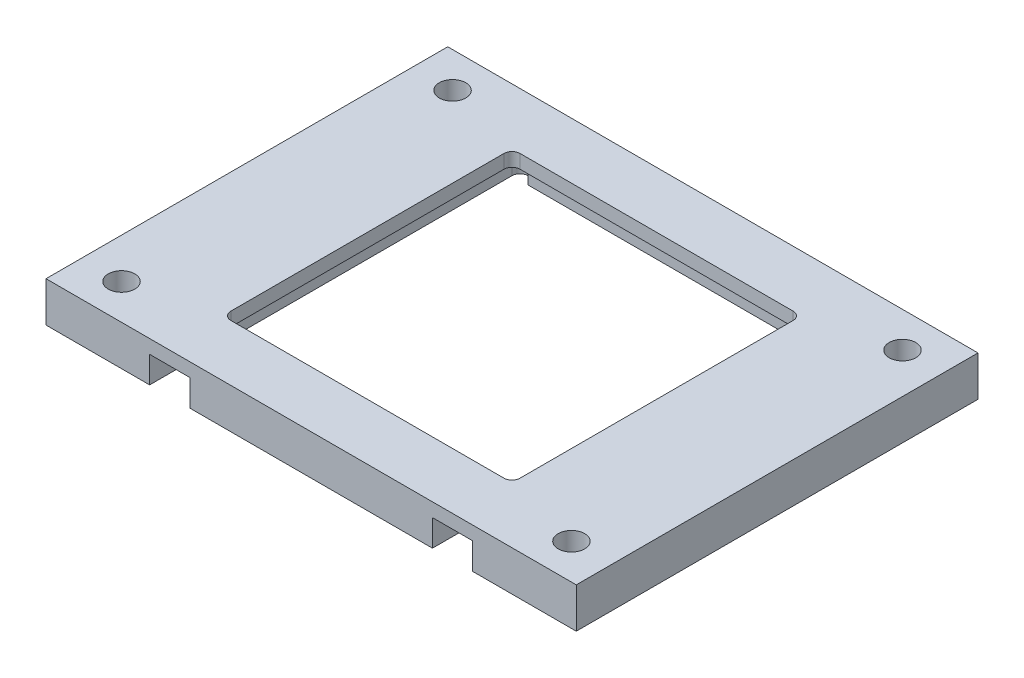
ISO-10303-21;
HEADER;
FILE_DESCRIPTION(('STEP AP214'),'2;1');
FILE_NAME('part.step','',(''),(''),'','','');
FILE_SCHEMA(('AUTOMOTIVE_DESIGN { 1 0 10303 214 1 1 1 1 }'));
ENDSEC;
DATA;
#1=APPLICATION_CONTEXT('core data for automotive mechanical design processes');
#2=APPLICATION_PROTOCOL_DEFINITION('international standard','automotive_design',2000,#1);
#3=PRODUCT_CONTEXT('',#1,'mechanical');
#4=PRODUCT('Part','Part','',(#3));
#5=PRODUCT_RELATED_PRODUCT_CATEGORY('part','',(#4));
#6=PRODUCT_DEFINITION_FORMATION('','',#4);
#7=PRODUCT_DEFINITION_CONTEXT('part definition',#1,'design');
#8=PRODUCT_DEFINITION('design','',#6,#7);
#9=PRODUCT_DEFINITION_SHAPE('','',#8);
#10=(LENGTH_UNIT() NAMED_UNIT(*) SI_UNIT(.MILLI.,.METRE.));
#11=(NAMED_UNIT(*) PLANE_ANGLE_UNIT() SI_UNIT($,.RADIAN.));
#12=(NAMED_UNIT(*) SI_UNIT($,.STERADIAN.) SOLID_ANGLE_UNIT());
#13=UNCERTAINTY_MEASURE_WITH_UNIT(LENGTH_MEASURE(1.E-05),#10,'distance_accuracy_value','');
#14=(GEOMETRIC_REPRESENTATION_CONTEXT(3) GLOBAL_UNCERTAINTY_ASSIGNED_CONTEXT((#13)) GLOBAL_UNIT_ASSIGNED_CONTEXT((#10,
#11,#12)) REPRESENTATION_CONTEXT('',''));
#15=CARTESIAN_POINT('',(0.,0.,0.));
#16=DIRECTION('',(0.,0.,1.));
#17=DIRECTION('',(1.,0.,0.));
#18=AXIS2_PLACEMENT_3D('',#15,#16,#17);
#19=CARTESIAN_POINT('',(0.,0.,0.));
#20=DIRECTION('',(0.,-1.,0.));
#21=DIRECTION('',(0.,0.,-1.));
#22=AXIS2_PLACEMENT_3D('',#19,#20,#21);
#23=PLANE('',#22);
#24=CARTESIAN_POINT('',(-19.1,0.,-20.1));
#25=DIRECTION('',(0.,-1.,0.));
#26=DIRECTION('',(0.,0.,-1.));
#27=AXIS2_PLACEMENT_3D('',#24,#25,#26);
#28=CIRCLE('',#27,1.);
#29=CARTESIAN_POINT('',(-18.1,0.,-20.1));
#30=VERTEX_POINT('',#29);
#31=CARTESIAN_POINT('',(-19.1,0.,-21.1));
#32=VERTEX_POINT('',#31);
#33=EDGE_CURVE('E63',#30,#32,#28,.F.);
#34=ORIENTED_EDGE('',*,*,#33,.T.);
#35=CARTESIAN_POINT('',(-19.1,0.,-20.1));
#36=DIRECTION('',(0.,-1.,0.));
#37=DIRECTION('',(0.,0.,-1.));
#38=AXIS2_PLACEMENT_3D('',#35,#36,#37);
#39=CIRCLE('',#38,1.);
#40=CARTESIAN_POINT('',(-20.1,0.,-20.1));
#41=VERTEX_POINT('',#40);
#42=EDGE_CURVE('E354',#32,#41,#39,.F.);
#43=ORIENTED_EDGE('',*,*,#42,.T.);
#44=DIRECTION('',(0.,0.,1.));
#45=VECTOR('',#44,1.);
#46=CARTESIAN_POINT('',(-20.1,0.,-21.1));
#47=LINE('',#46,#45);
#48=CARTESIAN_POINT('',(-20.1,0.,25.));
#49=VERTEX_POINT('',#48);
#50=EDGE_CURVE('E237',#41,#49,#47,.T.);
#51=ORIENTED_EDGE('',*,*,#50,.T.);
#52=DIRECTION('',(1.,0.,0.));
#53=VECTOR('',#52,1.);
#54=CARTESIAN_POINT('',(-33.,0.,25.));
#55=LINE('',#54,#53);
#56=CARTESIAN_POINT('',(-33.,0.,25.));
#57=VERTEX_POINT('',#56);
#58=EDGE_CURVE('E263',#57,#49,#55,.T.);
#59=ORIENTED_EDGE('',*,*,#58,.F.);
#60=DIRECTION('',(0.,0.,1.));
#61=VECTOR('',#60,1.);
#62=CARTESIAN_POINT('',(-33.,0.,25.));
#63=LINE('',#62,#61);
#64=CARTESIAN_POINT('',(-33.,0.,-25.));
#65=VERTEX_POINT('',#64);
#66=EDGE_CURVE('E279',#65,#57,#63,.T.);
#67=ORIENTED_EDGE('',*,*,#66,.F.);
#68=DIRECTION('',(-1.,0.,0.));
#69=VECTOR('',#68,1.);
#70=CARTESIAN_POINT('',(-33.,0.,-25.));
#71=LINE('',#70,#69);
#72=CARTESIAN_POINT('',(33.,0.,-25.));
#73=VERTEX_POINT('',#72);
#74=EDGE_CURVE('E276',#73,#65,#71,.T.);
#75=ORIENTED_EDGE('',*,*,#74,.F.);
#76=DIRECTION('',(0.,0.,-1.));
#77=VECTOR('',#76,1.);
#78=CARTESIAN_POINT('',(33.,0.,25.));
#79=LINE('',#78,#77);
#80=CARTESIAN_POINT('',(33.,0.,25.));
#81=VERTEX_POINT('',#80);
#82=EDGE_CURVE('E257',#81,#73,#79,.T.);
#83=ORIENTED_EDGE('',*,*,#82,.F.);
#84=CARTESIAN_POINT('',(20.1,0.,25.));
#85=VERTEX_POINT('',#84);
#86=EDGE_CURVE('E282',#85,#81,#55,.T.);
#87=ORIENTED_EDGE('',*,*,#86,.F.);
#88=DIRECTION('',(0.,0.,-1.));
#89=VECTOR('',#88,1.);
#90=CARTESIAN_POINT('',(20.1,0.,20.1));
#91=LINE('',#90,#89);
#92=CARTESIAN_POINT('',(20.1,0.,-20.1));
#93=VERTEX_POINT('',#92);
#94=EDGE_CURVE('E236',#85,#93,#91,.T.);
#95=ORIENTED_EDGE('',*,*,#94,.T.);
#96=CARTESIAN_POINT('',(19.1,0.,-20.1));
#97=DIRECTION('',(0.,-1.,0.));
#98=DIRECTION('',(0.,0.,-1.));
#99=AXIS2_PLACEMENT_3D('',#96,#97,#98);
#100=CIRCLE('',#99,1.);
#101=CARTESIAN_POINT('',(19.1,0.,-21.1));
#102=VERTEX_POINT('',#101);
#103=EDGE_CURVE('E70',#93,#102,#100,.F.);
#104=ORIENTED_EDGE('',*,*,#103,.T.);
#105=CARTESIAN_POINT('',(19.1,0.,-20.1));
#106=DIRECTION('',(0.,-1.,0.));
#107=DIRECTION('',(0.,0.,-1.));
#108=AXIS2_PLACEMENT_3D('',#105,#106,#107);
#109=CIRCLE('',#108,1.);
#110=CARTESIAN_POINT('',(18.1,0.,-20.1));
#111=VERTEX_POINT('',#110);
#112=EDGE_CURVE('E347',#102,#111,#109,.F.);
#113=ORIENTED_EDGE('',*,*,#112,.T.);
#114=DIRECTION('',(-1.,0.,0.));
#115=VECTOR('',#114,1.);
#116=CARTESIAN_POINT('',(-18.1,0.,-20.1));
#117=LINE('',#116,#115);
#118=EDGE_CURVE('E241',#111,#30,#117,.T.);
#119=ORIENTED_EDGE('',*,*,#118,.T.);
#120=EDGE_LOOP('',(#34,#43,#51,#59,#67,#75,#83,#87,#95,#104,#113,#119));
#121=FACE_BOUND('',#120,.T.);
#122=CARTESIAN_POINT('',(-28.,0.,20.6));
#123=DIRECTION('',(0.,1.,0.));
#124=DIRECTION('',(0.,0.,1.));
#125=AXIS2_PLACEMENT_3D('',#122,#123,#124);
#126=CIRCLE('',#125,1.65);
#127=CARTESIAN_POINT('',(-28.,0.,22.25));
#128=VERTEX_POINT('',#127);
#129=EDGE_CURVE('E506',#128,#128,#126,.T.);
#130=ORIENTED_EDGE('',*,*,#129,.T.);
#131=EDGE_LOOP('',(#130));
#132=FACE_BOUND('',#131,.T.);
#133=CARTESIAN_POINT('',(-28.,0.,-20.6));
#134=DIRECTION('',(0.,1.,0.));
#135=DIRECTION('',(0.,0.,1.));
#136=AXIS2_PLACEMENT_3D('',#133,#134,#135);
#137=CIRCLE('',#136,1.65);
#138=CARTESIAN_POINT('',(-28.,0.,-18.95));
#139=VERTEX_POINT('',#138);
#140=EDGE_CURVE('E522',#139,#139,#137,.T.);
#141=ORIENTED_EDGE('',*,*,#140,.T.);
#142=EDGE_LOOP('',(#141));
#143=FACE_BOUND('',#142,.T.);
#144=CARTESIAN_POINT('',(28.,0.,-20.6));
#145=DIRECTION('',(0.,1.,0.));
#146=DIRECTION('',(0.,0.,1.));
#147=AXIS2_PLACEMENT_3D('',#144,#145,#146);
#148=CIRCLE('',#147,1.65);
#149=CARTESIAN_POINT('',(28.,0.,-18.95));
#150=VERTEX_POINT('',#149);
#151=EDGE_CURVE('E514',#150,#150,#148,.T.);
#152=ORIENTED_EDGE('',*,*,#151,.T.);
#153=EDGE_LOOP('',(#152));
#154=FACE_BOUND('',#153,.T.);
#155=CARTESIAN_POINT('',(28.,0.,20.6));
#156=DIRECTION('',(0.,1.,0.));
#157=DIRECTION('',(0.,0.,1.));
#158=AXIS2_PLACEMENT_3D('',#155,#156,#157);
#159=CIRCLE('',#158,1.65);
#160=CARTESIAN_POINT('',(28.,0.,22.25));
#161=VERTEX_POINT('',#160);
#162=EDGE_CURVE('E501',#161,#161,#159,.T.);
#163=ORIENTED_EDGE('',*,*,#162,.T.);
#164=EDGE_LOOP('',(#163));
#165=FACE_BOUND('',#164,.T.);
#166=ADVANCED_FACE('F45',(#121,#132,#143,#154,#165),#23,.T.);
#167=CARTESIAN_POINT('',(-20.1,5.,-21.1));
#168=DIRECTION('',(1.,0.,0.));
#169=DIRECTION('',(0.,0.,-1.));
#170=AXIS2_PLACEMENT_3D('',#167,#168,#169);
#171=PLANE('',#170);
#172=ORIENTED_EDGE('',*,*,#50,.F.);
#173=DIRECTION('',(0.,-1.,0.));
#174=VECTOR('',#173,1.);
#175=CARTESIAN_POINT('',(-20.1,3.3,-20.1));
#176=LINE('',#175,#174);
#177=CARTESIAN_POINT('',(-20.1,3.3,-20.1));
#178=VERTEX_POINT('',#177);
#179=EDGE_CURVE('E316',#41,#178,#176,.F.);
#180=ORIENTED_EDGE('',*,*,#179,.T.);
#181=DIRECTION('',(0.,0.,1.));
#182=VECTOR('',#181,1.);
#183=CARTESIAN_POINT('',(-20.1,3.3,-21.1));
#184=LINE('',#183,#182);
#185=CARTESIAN_POINT('',(-20.1,3.3,25.));
#186=VERTEX_POINT('',#185);
#187=EDGE_CURVE('E404',#178,#186,#184,.T.);
#188=ORIENTED_EDGE('',*,*,#187,.T.);
#189=DIRECTION('',(0.,-1.,0.));
#190=VECTOR('',#189,1.);
#191=CARTESIAN_POINT('',(-20.1,0.,25.));
#192=LINE('',#191,#190);
#193=EDGE_CURVE('E230',#186,#49,#192,.T.);
#194=ORIENTED_EDGE('',*,*,#193,.T.);
#195=EDGE_LOOP('',(#172,#180,#188,#194));
#196=FACE_BOUND('',#195,.T.);
#197=ADVANCED_FACE('F401',(#196),#171,.T.);
#198=CARTESIAN_POINT('',(-20.1,5.,20.1));
#199=DIRECTION('',(0.,0.,-1.));
#200=DIRECTION('',(-1.,0.,0.));
#201=AXIS2_PLACEMENT_3D('',#198,#199,#200);
#202=PLANE('',#201);
#203=DIRECTION('',(0.,1.,0.));
#204=VECTOR('',#203,1.);
#205=CARTESIAN_POINT('',(-15.1,0.,20.1));
#206=LINE('',#205,#204);
#207=CARTESIAN_POINT('',(-15.1,0.,20.1));
#208=VERTEX_POINT('',#207);
#209=CARTESIAN_POINT('',(-15.1,3.3,20.1));
#210=VERTEX_POINT('',#209);
#211=EDGE_CURVE('E207',#208,#210,#206,.T.);
#212=ORIENTED_EDGE('',*,*,#211,.T.);
#213=DIRECTION('',(1.,0.,0.));
#214=VECTOR('',#213,1.);
#215=CARTESIAN_POINT('',(-20.1,3.3,20.1));
#216=LINE('',#215,#214);
#217=CARTESIAN_POINT('',(15.1,3.3,20.1));
#218=VERTEX_POINT('',#217);
#219=EDGE_CURVE('E490',#210,#218,#216,.T.);
#220=ORIENTED_EDGE('',*,*,#219,.T.);
#221=DIRECTION('',(0.,-1.,0.));
#222=VECTOR('',#221,1.);
#223=CARTESIAN_POINT('',(15.1,0.,20.1));
#224=LINE('',#223,#222);
#225=CARTESIAN_POINT('',(15.1,0.,20.1));
#226=VERTEX_POINT('',#225);
#227=EDGE_CURVE('E219',#218,#226,#224,.T.);
#228=ORIENTED_EDGE('',*,*,#227,.T.);
#229=DIRECTION('',(1.,0.,0.));
#230=VECTOR('',#229,1.);
#231=CARTESIAN_POINT('',(-20.1,0.,20.1));
#232=LINE('',#231,#230);
#233=EDGE_CURVE('E226',#208,#226,#232,.T.);
#234=ORIENTED_EDGE('',*,*,#233,.F.);
#235=EDGE_LOOP('',(#212,#220,#228,#234));
#236=FACE_BOUND('',#235,.T.);
#237=ADVANCED_FACE('F233',(#236),#202,.T.);
#238=CARTESIAN_POINT('',(20.1,5.,20.1));
#239=DIRECTION('',(-1.,0.,0.));
#240=DIRECTION('',(0.,0.,1.));
#241=AXIS2_PLACEMENT_3D('',#238,#239,#240);
#242=PLANE('',#241);
#243=DIRECTION('',(0.,0.,-1.));
#244=VECTOR('',#243,1.);
#245=CARTESIAN_POINT('',(20.1,3.3,20.1));
#246=LINE('',#245,#244);
#247=CARTESIAN_POINT('',(20.1,3.3,25.));
#248=VERTEX_POINT('',#247);
#249=CARTESIAN_POINT('',(20.1,3.3,-20.1));
#250=VERTEX_POINT('',#249);
#251=EDGE_CURVE('E493',#248,#250,#246,.T.);
#252=ORIENTED_EDGE('',*,*,#251,.T.);
#253=DIRECTION('',(0.,-1.,0.));
#254=VECTOR('',#253,1.);
#255=CARTESIAN_POINT('',(20.1,0.,-20.1));
#256=LINE('',#255,#254);
#257=EDGE_CURVE('E313',#250,#93,#256,.T.);
#258=ORIENTED_EDGE('',*,*,#257,.T.);
#259=ORIENTED_EDGE('',*,*,#94,.F.);
#260=DIRECTION('',(0.,1.,0.));
#261=VECTOR('',#260,1.);
#262=CARTESIAN_POINT('',(20.1,0.,25.));
#263=LINE('',#262,#261);
#264=EDGE_CURVE('E446',#85,#248,#263,.T.);
#265=ORIENTED_EDGE('',*,*,#264,.T.);
#266=EDGE_LOOP('',(#252,#258,#259,#265));
#267=FACE_BOUND('',#266,.T.);
#268=ADVANCED_FACE('F571',(#267),#242,.T.);
#269=CARTESIAN_POINT('',(-18.1,5.,-20.1));
#270=DIRECTION('',(0.,0.,1.));
#271=DIRECTION('',(1.,0.,0.));
#272=AXIS2_PLACEMENT_3D('',#269,#270,#271);
#273=PLANE('',#272);
#274=DIRECTION('',(0.,-1.,0.));
#275=VECTOR('',#274,1.);
#276=CARTESIAN_POINT('',(18.1,5.,-20.1));
#277=LINE('',#276,#275);
#278=CARTESIAN_POINT('',(18.1,3.3,-20.1));
#279=VERTEX_POINT('',#278);
#280=EDGE_CURVE('E253',#279,#111,#277,.T.);
#281=ORIENTED_EDGE('',*,*,#280,.F.);
#282=DIRECTION('',(-1.,0.,0.));
#283=VECTOR('',#282,1.);
#284=CARTESIAN_POINT('',(18.1,3.3,-20.1));
#285=LINE('',#284,#283);
#286=CARTESIAN_POINT('',(-18.1,3.3,-20.1));
#287=VERTEX_POINT('',#286);
#288=EDGE_CURVE('E497',#279,#287,#285,.T.);
#289=ORIENTED_EDGE('',*,*,#288,.T.);
#290=DIRECTION('',(0.,-1.,0.));
#291=VECTOR('',#290,1.);
#292=CARTESIAN_POINT('',(-18.1,5.,-20.1));
#293=LINE('',#292,#291);
#294=EDGE_CURVE('E249',#287,#30,#293,.T.);
#295=ORIENTED_EDGE('',*,*,#294,.T.);
#296=ORIENTED_EDGE('',*,*,#118,.F.);
#297=EDGE_LOOP('',(#281,#289,#295,#296));
#298=FACE_BOUND('',#297,.T.);
#299=ADVANCED_FACE('F565',(#298),#273,.T.);
#300=CARTESIAN_POINT('',(0.,5.,0.));
#301=DIRECTION('',(0.,-1.,0.));
#302=DIRECTION('',(0.,0.,-1.));
#303=AXIS2_PLACEMENT_3D('',#300,#301,#302);
#304=PLANE('',#303);
#305=DIRECTION('',(0.,0.,-1.));
#306=VECTOR('',#305,1.);
#307=CARTESIAN_POINT('',(33.,5.,25.));
#308=LINE('',#307,#306);
#309=CARTESIAN_POINT('',(33.,5.,25.));
#310=VERTEX_POINT('',#309);
#311=CARTESIAN_POINT('',(33.,5.,-25.));
#312=VERTEX_POINT('',#311);
#313=EDGE_CURVE('E258',#310,#312,#308,.T.);
#314=ORIENTED_EDGE('',*,*,#313,.T.);
#315=DIRECTION('',(-1.,0.,0.));
#316=VECTOR('',#315,1.);
#317=CARTESIAN_POINT('',(-33.,5.,-25.));
#318=LINE('',#317,#316);
#319=CARTESIAN_POINT('',(-33.,5.,-25.));
#320=VERTEX_POINT('',#319);
#321=EDGE_CURVE('E262',#312,#320,#318,.T.);
#322=ORIENTED_EDGE('',*,*,#321,.T.);
#323=DIRECTION('',(0.,0.,1.));
#324=VECTOR('',#323,1.);
#325=CARTESIAN_POINT('',(-33.,5.,25.));
#326=LINE('',#325,#324);
#327=CARTESIAN_POINT('',(-33.,5.,25.));
#328=VERTEX_POINT('',#327);
#329=EDGE_CURVE('E266',#320,#328,#326,.T.);
#330=ORIENTED_EDGE('',*,*,#329,.T.);
#331=DIRECTION('',(1.,0.,0.));
#332=VECTOR('',#331,1.);
#333=CARTESIAN_POINT('',(-33.,5.,25.));
#334=LINE('',#333,#332);
#335=EDGE_CURVE('E269',#328,#310,#334,.T.);
#336=ORIENTED_EDGE('',*,*,#335,.T.);
#337=EDGE_LOOP('',(#314,#322,#330,#336));
#338=FACE_BOUND('',#337,.T.);
#339=CARTESIAN_POINT('',(-28.,5.,-20.6));
#340=DIRECTION('',(0.,1.,0.));
#341=DIRECTION('',(0.,0.,1.));
#342=AXIS2_PLACEMENT_3D('',#339,#340,#341);
#343=CIRCLE('',#342,1.65);
#344=CARTESIAN_POINT('',(-28.,5.,-18.95));
#345=VERTEX_POINT('',#344);
#346=EDGE_CURVE('E243',#345,#345,#343,.T.);
#347=ORIENTED_EDGE('',*,*,#346,.F.);
#348=EDGE_LOOP('',(#347));
#349=FACE_BOUND('',#348,.T.);
#350=CARTESIAN_POINT('',(28.,5.,-20.6));
#351=DIRECTION('',(0.,1.,0.));
#352=DIRECTION('',(0.,0.,1.));
#353=AXIS2_PLACEMENT_3D('',#350,#351,#352);
#354=CIRCLE('',#353,1.65);
#355=CARTESIAN_POINT('',(28.,5.,-18.95));
#356=VERTEX_POINT('',#355);
#357=EDGE_CURVE('E518',#356,#356,#354,.T.);
#358=ORIENTED_EDGE('',*,*,#357,.F.);
#359=EDGE_LOOP('',(#358));
#360=FACE_BOUND('',#359,.T.);
#361=CARTESIAN_POINT('',(-28.,5.,20.6));
#362=DIRECTION('',(0.,1.,0.));
#363=DIRECTION('',(0.,0.,1.));
#364=AXIS2_PLACEMENT_3D('',#361,#362,#363);
#365=CIRCLE('',#364,1.65);
#366=CARTESIAN_POINT('',(-28.,5.,22.25));
#367=VERTEX_POINT('',#366);
#368=EDGE_CURVE('E510',#367,#367,#365,.T.);
#369=ORIENTED_EDGE('',*,*,#368,.F.);
#370=EDGE_LOOP('',(#369));
#371=FACE_BOUND('',#370,.T.);
#372=CARTESIAN_POINT('',(28.,5.,20.6));
#373=DIRECTION('',(0.,1.,0.));
#374=DIRECTION('',(0.,0.,1.));
#375=AXIS2_PLACEMENT_3D('',#372,#373,#374);
#376=CIRCLE('',#375,1.65);
#377=CARTESIAN_POINT('',(28.,5.,22.25));
#378=VERTEX_POINT('',#377);
#379=EDGE_CURVE('E502',#378,#378,#376,.T.);
#380=ORIENTED_EDGE('',*,*,#379,.F.);
#381=EDGE_LOOP('',(#380));
#382=FACE_BOUND('',#381,.T.);
#383=DIRECTION('',(0.,0.,1.));
#384=VECTOR('',#383,1.);
#385=CARTESIAN_POINT('',(-18.,5.,-18.));
#386=LINE('',#385,#384);
#387=CARTESIAN_POINT('',(-18.,5.,-17.));
#388=VERTEX_POINT('',#387);
#389=CARTESIAN_POINT('',(-18.,5.,17.));
#390=VERTEX_POINT('',#389);
#391=EDGE_CURVE('E437',#388,#390,#386,.T.);
#392=ORIENTED_EDGE('',*,*,#391,.F.);
#393=CARTESIAN_POINT('',(-17.,5.,-17.));
#394=DIRECTION('',(0.,-1.,0.));
#395=DIRECTION('',(0.,0.,-1.));
#396=AXIS2_PLACEMENT_3D('',#393,#394,#395);
#397=CIRCLE('',#396,1.);
#398=CARTESIAN_POINT('',(-17.,5.,-18.));
#399=VERTEX_POINT('',#398);
#400=EDGE_CURVE('E55',#388,#399,#397,.T.);
#401=ORIENTED_EDGE('',*,*,#400,.T.);
#402=DIRECTION('',(-1.,0.,0.));
#403=VECTOR('',#402,1.);
#404=CARTESIAN_POINT('',(18.,5.,-18.));
#405=LINE('',#404,#403);
#406=CARTESIAN_POINT('',(17.,5.,-18.));
#407=VERTEX_POINT('',#406);
#408=EDGE_CURVE('E462',#407,#399,#405,.T.);
#409=ORIENTED_EDGE('',*,*,#408,.F.);
#410=CARTESIAN_POINT('',(17.,5.,-17.));
#411=DIRECTION('',(0.,-1.,0.));
#412=DIRECTION('',(0.,0.,-1.));
#413=AXIS2_PLACEMENT_3D('',#410,#411,#412);
#414=CIRCLE('',#413,1.);
#415=CARTESIAN_POINT('',(18.,5.,-17.));
#416=VERTEX_POINT('',#415);
#417=EDGE_CURVE('E369',#407,#416,#414,.T.);
#418=ORIENTED_EDGE('',*,*,#417,.T.);
#419=DIRECTION('',(0.,0.,-1.));
#420=VECTOR('',#419,1.);
#421=CARTESIAN_POINT('',(18.,5.,18.));
#422=LINE('',#421,#420);
#423=CARTESIAN_POINT('',(18.,5.,17.));
#424=VERTEX_POINT('',#423);
#425=EDGE_CURVE('E481',#424,#416,#422,.T.);
#426=ORIENTED_EDGE('',*,*,#425,.F.);
#427=CARTESIAN_POINT('',(17.,5.,17.));
#428=DIRECTION('',(0.,-1.,0.));
#429=DIRECTION('',(0.,0.,-1.));
#430=AXIS2_PLACEMENT_3D('',#427,#428,#429);
#431=CIRCLE('',#430,1.);
#432=CARTESIAN_POINT('',(17.,5.,18.));
#433=VERTEX_POINT('',#432);
#434=EDGE_CURVE('E363',#424,#433,#431,.T.);
#435=ORIENTED_EDGE('',*,*,#434,.T.);
#436=DIRECTION('',(1.,0.,0.));
#437=VECTOR('',#436,1.);
#438=CARTESIAN_POINT('',(-18.,5.,18.));
#439=LINE('',#438,#437);
#440=CARTESIAN_POINT('',(-17.,5.,18.));
#441=VERTEX_POINT('',#440);
#442=EDGE_CURVE('E477',#441,#433,#439,.T.);
#443=ORIENTED_EDGE('',*,*,#442,.F.);
#444=CARTESIAN_POINT('',(-17.,5.,17.));
#445=DIRECTION('',(0.,-1.,0.));
#446=DIRECTION('',(0.,0.,-1.));
#447=AXIS2_PLACEMENT_3D('',#444,#445,#446);
#448=CIRCLE('',#447,1.);
#449=EDGE_CURVE('E357',#441,#390,#448,.T.);
#450=ORIENTED_EDGE('',*,*,#449,.T.);
#451=EDGE_LOOP('',(#392,#401,#409,#418,#426,#435,#443,#450));
#452=FACE_BOUND('',#451,.T.);
#453=ADVANCED_FACE('F558',(#338,#349,#360,#371,#382,#452),#304,.F.);
#454=DIRECTION('',(0.,0.,1.));
#455=VECTOR('',#454,1.);
#456=CARTESIAN_POINT('',(-15.1,0.,-25.001));
#457=LINE('',#456,#455);
#458=CARTESIAN_POINT('',(-15.1,0.,25.));
#459=VERTEX_POINT('',#458);
#460=EDGE_CURVE('E211',#208,#459,#457,.T.);
#461=ORIENTED_EDGE('',*,*,#460,.F.);
#462=ORIENTED_EDGE('',*,*,#233,.T.);
#463=DIRECTION('',(0.,0.,1.));
#464=VECTOR('',#463,1.);
#465=CARTESIAN_POINT('',(15.1,0.,-25.001));
#466=LINE('',#465,#464);
#467=CARTESIAN_POINT('',(15.1,0.,25.));
#468=VERTEX_POINT('',#467);
#469=EDGE_CURVE('E445',#226,#468,#466,.T.);
#470=ORIENTED_EDGE('',*,*,#469,.T.);
#471=EDGE_CURVE('E228',#459,#468,#55,.T.);
#472=ORIENTED_EDGE('',*,*,#471,.F.);
#473=EDGE_LOOP('',(#461,#462,#470,#472));
#474=FACE_BOUND('',#473,.T.);
#475=ADVANCED_FACE('F224',(#474),#23,.T.);
#476=CARTESIAN_POINT('',(33.,5.,25.));
#477=DIRECTION('',(-1.,0.,0.));
#478=DIRECTION('',(0.,0.,1.));
#479=AXIS2_PLACEMENT_3D('',#476,#477,#478);
#480=PLANE('',#479);
#481=ORIENTED_EDGE('',*,*,#82,.T.);
#482=DIRECTION('',(0.,-1.,0.));
#483=VECTOR('',#482,1.);
#484=CARTESIAN_POINT('',(33.,5.,-25.));
#485=LINE('',#484,#483);
#486=EDGE_CURVE('E297',#312,#73,#485,.T.);
#487=ORIENTED_EDGE('',*,*,#486,.F.);
#488=ORIENTED_EDGE('',*,*,#313,.F.);
#489=DIRECTION('',(0.,-1.,0.));
#490=VECTOR('',#489,1.);
#491=CARTESIAN_POINT('',(33.,5.,25.));
#492=LINE('',#491,#490);
#493=EDGE_CURVE('E272',#310,#81,#492,.T.);
#494=ORIENTED_EDGE('',*,*,#493,.T.);
#495=EDGE_LOOP('',(#481,#487,#488,#494));
#496=FACE_BOUND('',#495,.T.);
#497=ADVANCED_FACE('F425',(#496),#480,.F.);
#498=CARTESIAN_POINT('',(-33.,5.,-25.));
#499=DIRECTION('',(0.,0.,1.));
#500=DIRECTION('',(1.,0.,0.));
#501=AXIS2_PLACEMENT_3D('',#498,#499,#500);
#502=PLANE('',#501);
#503=ORIENTED_EDGE('',*,*,#74,.T.);
#504=DIRECTION('',(0.,-1.,0.));
#505=VECTOR('',#504,1.);
#506=CARTESIAN_POINT('',(-33.,5.,-25.));
#507=LINE('',#506,#505);
#508=EDGE_CURVE('E293',#320,#65,#507,.T.);
#509=ORIENTED_EDGE('',*,*,#508,.F.);
#510=ORIENTED_EDGE('',*,*,#321,.F.);
#511=ORIENTED_EDGE('',*,*,#486,.T.);
#512=EDGE_LOOP('',(#503,#509,#510,#511));
#513=FACE_BOUND('',#512,.T.);
#514=ADVANCED_FACE('F421',(#513),#502,.F.);
#515=CARTESIAN_POINT('',(-33.,5.,25.));
#516=DIRECTION('',(1.,0.,0.));
#517=DIRECTION('',(0.,0.,-1.));
#518=AXIS2_PLACEMENT_3D('',#515,#516,#517);
#519=PLANE('',#518);
#520=ORIENTED_EDGE('',*,*,#66,.T.);
#521=DIRECTION('',(0.,-1.,0.));
#522=VECTOR('',#521,1.);
#523=CARTESIAN_POINT('',(-33.,5.,25.));
#524=LINE('',#523,#522);
#525=EDGE_CURVE('E289',#328,#57,#524,.T.);
#526=ORIENTED_EDGE('',*,*,#525,.F.);
#527=ORIENTED_EDGE('',*,*,#329,.F.);
#528=ORIENTED_EDGE('',*,*,#508,.T.);
#529=EDGE_LOOP('',(#520,#526,#527,#528));
#530=FACE_BOUND('',#529,.T.);
#531=ADVANCED_FACE('F417',(#530),#519,.F.);
#532=CARTESIAN_POINT('',(-33.,5.,25.));
#533=DIRECTION('',(0.,0.,-1.));
#534=DIRECTION('',(-1.,0.,0.));
#535=AXIS2_PLACEMENT_3D('',#532,#533,#534);
#536=PLANE('',#535);
#537=ORIENTED_EDGE('',*,*,#58,.T.);
#538=ORIENTED_EDGE('',*,*,#193,.F.);
#539=DIRECTION('',(-1.,0.,0.));
#540=VECTOR('',#539,1.);
#541=CARTESIAN_POINT('',(-20.1,3.3,25.));
#542=LINE('',#541,#540);
#543=CARTESIAN_POINT('',(-15.1,3.3,25.));
#544=VERTEX_POINT('',#543);
#545=EDGE_CURVE('E433',#544,#186,#542,.T.);
#546=ORIENTED_EDGE('',*,*,#545,.F.);
#547=DIRECTION('',(0.,1.,0.));
#548=VECTOR('',#547,1.);
#549=CARTESIAN_POINT('',(-15.1,0.,25.));
#550=LINE('',#549,#548);
#551=EDGE_CURVE('E409',#459,#544,#550,.T.);
#552=ORIENTED_EDGE('',*,*,#551,.F.);
#553=ORIENTED_EDGE('',*,*,#471,.T.);
#554=DIRECTION('',(0.,-1.,0.));
#555=VECTOR('',#554,1.);
#556=CARTESIAN_POINT('',(15.1,0.,25.));
#557=LINE('',#556,#555);
#558=CARTESIAN_POINT('',(15.1,3.3,25.));
#559=VERTEX_POINT('',#558);
#560=EDGE_CURVE('E379',#559,#468,#557,.T.);
#561=ORIENTED_EDGE('',*,*,#560,.F.);
#562=DIRECTION('',(-1.,0.,0.));
#563=VECTOR('',#562,1.);
#564=CARTESIAN_POINT('',(20.1,3.3,25.));
#565=LINE('',#564,#563);
#566=EDGE_CURVE('E384',#248,#559,#565,.T.);
#567=ORIENTED_EDGE('',*,*,#566,.F.);
#568=ORIENTED_EDGE('',*,*,#264,.F.);
#569=ORIENTED_EDGE('',*,*,#86,.T.);
#570=ORIENTED_EDGE('',*,*,#493,.F.);
#571=ORIENTED_EDGE('',*,*,#335,.F.);
#572=ORIENTED_EDGE('',*,*,#525,.T.);
#573=EDGE_LOOP('',(#537,#538,#546,#552,#553,#561,#567,#568,#569,#570,#571,#572));
#574=FACE_BOUND('',#573,.T.);
#575=ADVANCED_FACE('F411',(#574),#536,.F.);
#576=CARTESIAN_POINT('',(-28.,5.,-20.6));
#577=DIRECTION('',(0.,-1.,0.));
#578=DIRECTION('',(0.,0.,-1.));
#579=AXIS2_PLACEMENT_3D('',#576,#577,#578);
#580=CYLINDRICAL_SURFACE('',#579,1.65);
#581=ORIENTED_EDGE('',*,*,#346,.T.);
#582=EDGE_LOOP('',(#581));
#583=FACE_BOUND('',#582,.T.);
#584=ORIENTED_EDGE('',*,*,#140,.F.);
#585=EDGE_LOOP('',(#584));
#586=FACE_BOUND('',#585,.T.);
#587=ADVANCED_FACE('F534',(#583,#586),#580,.F.);
#588=CARTESIAN_POINT('',(28.,5.,-20.6));
#589=DIRECTION('',(0.,-1.,0.));
#590=DIRECTION('',(0.,0.,-1.));
#591=AXIS2_PLACEMENT_3D('',#588,#589,#590);
#592=CYLINDRICAL_SURFACE('',#591,1.65);
#593=ORIENTED_EDGE('',*,*,#357,.T.);
#594=EDGE_LOOP('',(#593));
#595=FACE_BOUND('',#594,.T.);
#596=ORIENTED_EDGE('',*,*,#151,.F.);
#597=EDGE_LOOP('',(#596));
#598=FACE_BOUND('',#597,.T.);
#599=ADVANCED_FACE('F536',(#595,#598),#592,.F.);
#600=CARTESIAN_POINT('',(-28.,5.,20.6));
#601=DIRECTION('',(0.,-1.,0.));
#602=DIRECTION('',(0.,0.,-1.));
#603=AXIS2_PLACEMENT_3D('',#600,#601,#602);
#604=CYLINDRICAL_SURFACE('',#603,1.65);
#605=ORIENTED_EDGE('',*,*,#368,.T.);
#606=EDGE_LOOP('',(#605));
#607=FACE_BOUND('',#606,.T.);
#608=ORIENTED_EDGE('',*,*,#129,.F.);
#609=EDGE_LOOP('',(#608));
#610=FACE_BOUND('',#609,.T.);
#611=ADVANCED_FACE('F543',(#607,#610),#604,.F.);
#612=CARTESIAN_POINT('',(28.,5.,20.6));
#613=DIRECTION('',(0.,-1.,0.));
#614=DIRECTION('',(0.,0.,-1.));
#615=AXIS2_PLACEMENT_3D('',#612,#613,#614);
#616=CYLINDRICAL_SURFACE('',#615,1.65);
#617=ORIENTED_EDGE('',*,*,#379,.T.);
#618=EDGE_LOOP('',(#617));
#619=FACE_BOUND('',#618,.T.);
#620=ORIENTED_EDGE('',*,*,#162,.F.);
#621=EDGE_LOOP('',(#620));
#622=FACE_BOUND('',#621,.T.);
#623=ADVANCED_FACE('F615',(#619,#622),#616,.F.);
#624=CARTESIAN_POINT('',(0.,3.3,0.));
#625=DIRECTION('',(0.,1.,0.));
#626=DIRECTION('',(0.,0.,1.));
#627=AXIS2_PLACEMENT_3D('',#624,#625,#626);
#628=PLANE('',#627);
#629=DIRECTION('',(0.,0.,-1.));
#630=VECTOR('',#629,1.);
#631=CARTESIAN_POINT('',(18.,3.3,18.));
#632=LINE('',#631,#630);
#633=CARTESIAN_POINT('',(18.,3.3,17.));
#634=VERTEX_POINT('',#633);
#635=CARTESIAN_POINT('',(18.,3.3,-17.));
#636=VERTEX_POINT('',#635);
#637=EDGE_CURVE('E466',#634,#636,#632,.T.);
#638=ORIENTED_EDGE('',*,*,#637,.T.);
#639=CARTESIAN_POINT('',(17.,3.3,-17.));
#640=DIRECTION('',(0.,1.,0.));
#641=DIRECTION('',(0.,0.,1.));
#642=AXIS2_PLACEMENT_3D('',#639,#640,#641);
#643=CIRCLE('',#642,1.);
#644=CARTESIAN_POINT('',(17.,3.3,-18.));
#645=VERTEX_POINT('',#644);
#646=EDGE_CURVE('E372',#636,#645,#643,.T.);
#647=ORIENTED_EDGE('',*,*,#646,.T.);
#648=DIRECTION('',(-1.,0.,0.));
#649=VECTOR('',#648,1.);
#650=CARTESIAN_POINT('',(18.,3.3,-18.));
#651=LINE('',#650,#649);
#652=CARTESIAN_POINT('',(-17.,3.3,-18.));
#653=VERTEX_POINT('',#652);
#654=EDGE_CURVE('E470',#645,#653,#651,.T.);
#655=ORIENTED_EDGE('',*,*,#654,.T.);
#656=CARTESIAN_POINT('',(-17.,3.3,-17.));
#657=DIRECTION('',(0.,1.,0.));
#658=DIRECTION('',(0.,0.,1.));
#659=AXIS2_PLACEMENT_3D('',#656,#657,#658);
#660=CIRCLE('',#659,1.);
#661=CARTESIAN_POINT('',(-18.,3.3,-17.));
#662=VERTEX_POINT('',#661);
#663=EDGE_CURVE('E11',#653,#662,#660,.T.);
#664=ORIENTED_EDGE('',*,*,#663,.T.);
#665=DIRECTION('',(0.,0.,1.));
#666=VECTOR('',#665,1.);
#667=CARTESIAN_POINT('',(-18.,3.3,-18.));
#668=LINE('',#667,#666);
#669=CARTESIAN_POINT('',(-18.,3.3,17.));
#670=VERTEX_POINT('',#669);
#671=EDGE_CURVE('E457',#662,#670,#668,.T.);
#672=ORIENTED_EDGE('',*,*,#671,.T.);
#673=CARTESIAN_POINT('',(-17.,3.3,17.));
#674=DIRECTION('',(0.,1.,0.));
#675=DIRECTION('',(0.,0.,1.));
#676=AXIS2_PLACEMENT_3D('',#673,#674,#675);
#677=CIRCLE('',#676,1.);
#678=CARTESIAN_POINT('',(-17.,3.3,18.));
#679=VERTEX_POINT('',#678);
#680=EDGE_CURVE('E360',#670,#679,#677,.T.);
#681=ORIENTED_EDGE('',*,*,#680,.T.);
#682=DIRECTION('',(1.,0.,0.));
#683=VECTOR('',#682,1.);
#684=CARTESIAN_POINT('',(-18.,3.3,18.));
#685=LINE('',#684,#683);
#686=CARTESIAN_POINT('',(17.,3.3,18.));
#687=VERTEX_POINT('',#686);
#688=EDGE_CURVE('E461',#679,#687,#685,.T.);
#689=ORIENTED_EDGE('',*,*,#688,.T.);
#690=CARTESIAN_POINT('',(17.,3.3,17.));
#691=DIRECTION('',(0.,1.,0.));
#692=DIRECTION('',(0.,0.,1.));
#693=AXIS2_PLACEMENT_3D('',#690,#691,#692);
#694=CIRCLE('',#693,1.);
#695=EDGE_CURVE('E366',#687,#634,#694,.T.);
#696=ORIENTED_EDGE('',*,*,#695,.T.);
#697=EDGE_LOOP('',(#638,#647,#655,#664,#672,#681,#689,#696));
#698=FACE_BOUND('',#697,.T.);
#699=ORIENTED_EDGE('',*,*,#288,.F.);
#700=CARTESIAN_POINT('',(19.1,3.3,-20.1));
#701=DIRECTION('',(0.,1.,0.));
#702=DIRECTION('',(0.,0.,1.));
#703=AXIS2_PLACEMENT_3D('',#700,#701,#702);
#704=CIRCLE('',#703,1.);
#705=CARTESIAN_POINT('',(19.1,3.3,-21.1));
#706=VERTEX_POINT('',#705);
#707=EDGE_CURVE('E310',#279,#706,#704,.F.);
#708=ORIENTED_EDGE('',*,*,#707,.T.);
#709=CARTESIAN_POINT('',(19.1,3.3,-20.1));
#710=DIRECTION('',(0.,1.,0.));
#711=DIRECTION('',(0.,0.,1.));
#712=AXIS2_PLACEMENT_3D('',#709,#710,#711);
#713=CIRCLE('',#712,1.);
#714=EDGE_CURVE('E307',#706,#250,#713,.F.);
#715=ORIENTED_EDGE('',*,*,#714,.T.);
#716=ORIENTED_EDGE('',*,*,#251,.F.);
#717=ORIENTED_EDGE('',*,*,#566,.T.);
#718=DIRECTION('',(0.,0.,1.));
#719=VECTOR('',#718,1.);
#720=CARTESIAN_POINT('',(15.1,3.3,-25.001));
#721=LINE('',#720,#719);
#722=EDGE_CURVE('E442',#218,#559,#721,.T.);
#723=ORIENTED_EDGE('',*,*,#722,.F.);
#724=ORIENTED_EDGE('',*,*,#219,.F.);
#725=DIRECTION('',(0.,0.,1.));
#726=VECTOR('',#725,1.);
#727=CARTESIAN_POINT('',(-15.1,3.3,-25.001));
#728=LINE('',#727,#726);
#729=EDGE_CURVE('E213',#210,#544,#728,.T.);
#730=ORIENTED_EDGE('',*,*,#729,.T.);
#731=ORIENTED_EDGE('',*,*,#545,.T.);
#732=ORIENTED_EDGE('',*,*,#187,.F.);
#733=CARTESIAN_POINT('',(-19.1,3.3,-20.1));
#734=DIRECTION('',(0.,1.,0.));
#735=DIRECTION('',(0.,0.,1.));
#736=AXIS2_PLACEMENT_3D('',#733,#734,#735);
#737=CIRCLE('',#736,1.);
#738=CARTESIAN_POINT('',(-19.1,3.3,-21.1));
#739=VERTEX_POINT('',#738);
#740=EDGE_CURVE('E301',#178,#739,#737,.F.);
#741=ORIENTED_EDGE('',*,*,#740,.T.);
#742=CARTESIAN_POINT('',(-19.1,3.3,-20.1));
#743=DIRECTION('',(0.,1.,0.));
#744=DIRECTION('',(0.,0.,1.));
#745=AXIS2_PLACEMENT_3D('',#742,#743,#744);
#746=CIRCLE('',#745,1.);
#747=EDGE_CURVE('E304',#739,#287,#746,.F.);
#748=ORIENTED_EDGE('',*,*,#747,.T.);
#749=EDGE_LOOP('',(#699,#708,#715,#716,#717,#723,#724,#730,#731,#732,#741,#748));
#750=FACE_BOUND('',#749,.T.);
#751=ADVANCED_FACE('F589',(#698,#750),#628,.F.);
#752=CARTESIAN_POINT('',(-18.,3.3,-18.));
#753=DIRECTION('',(-1.,0.,0.));
#754=DIRECTION('',(0.,0.,1.));
#755=AXIS2_PLACEMENT_3D('',#752,#753,#754);
#756=PLANE('',#755);
#757=ORIENTED_EDGE('',*,*,#391,.T.);
#758=DIRECTION('',(0.,1.,0.));
#759=VECTOR('',#758,1.);
#760=CARTESIAN_POINT('',(-18.,3.3,17.));
#761=LINE('',#760,#759);
#762=EDGE_CURVE('E330',#390,#670,#761,.F.);
#763=ORIENTED_EDGE('',*,*,#762,.T.);
#764=ORIENTED_EDGE('',*,*,#671,.F.);
#765=DIRECTION('',(0.,1.,0.));
#766=VECTOR('',#765,1.);
#767=CARTESIAN_POINT('',(-18.,5.,-17.));
#768=LINE('',#767,#766);
#769=EDGE_CURVE('E326',#662,#388,#768,.T.);
#770=ORIENTED_EDGE('',*,*,#769,.T.);
#771=EDGE_LOOP('',(#757,#763,#764,#770));
#772=FACE_BOUND('',#771,.T.);
#773=ADVANCED_FACE('F606',(#772),#756,.F.);
#774=CARTESIAN_POINT('',(18.,3.3,-18.));
#775=DIRECTION('',(0.,0.,-1.));
#776=DIRECTION('',(-1.,0.,0.));
#777=AXIS2_PLACEMENT_3D('',#774,#775,#776);
#778=PLANE('',#777);
#779=ORIENTED_EDGE('',*,*,#654,.F.);
#780=DIRECTION('',(0.,1.,0.));
#781=VECTOR('',#780,1.);
#782=CARTESIAN_POINT('',(17.,5.,-18.));
#783=LINE('',#782,#781);
#784=EDGE_CURVE('E343',#645,#407,#783,.T.);
#785=ORIENTED_EDGE('',*,*,#784,.T.);
#786=ORIENTED_EDGE('',*,*,#408,.T.);
#787=DIRECTION('',(0.,1.,0.));
#788=VECTOR('',#787,1.);
#789=CARTESIAN_POINT('',(-17.,3.3,-18.));
#790=LINE('',#789,#788);
#791=EDGE_CURVE('E340',#399,#653,#790,.F.);
#792=ORIENTED_EDGE('',*,*,#791,.T.);
#793=EDGE_LOOP('',(#779,#785,#786,#792));
#794=FACE_BOUND('',#793,.T.);
#795=ADVANCED_FACE('F603',(#794),#778,.F.);
#796=CARTESIAN_POINT('',(18.,3.3,18.));
#797=DIRECTION('',(1.,0.,0.));
#798=DIRECTION('',(0.,0.,-1.));
#799=AXIS2_PLACEMENT_3D('',#796,#797,#798);
#800=PLANE('',#799);
#801=ORIENTED_EDGE('',*,*,#637,.F.);
#802=DIRECTION('',(0.,1.,0.));
#803=VECTOR('',#802,1.);
#804=CARTESIAN_POINT('',(18.,5.,17.));
#805=LINE('',#804,#803);
#806=EDGE_CURVE('E336',#634,#424,#805,.T.);
#807=ORIENTED_EDGE('',*,*,#806,.T.);
#808=ORIENTED_EDGE('',*,*,#425,.T.);
#809=DIRECTION('',(0.,1.,0.));
#810=VECTOR('',#809,1.);
#811=CARTESIAN_POINT('',(18.,3.3,-17.));
#812=LINE('',#811,#810);
#813=EDGE_CURVE('E333',#416,#636,#812,.F.);
#814=ORIENTED_EDGE('',*,*,#813,.T.);
#815=EDGE_LOOP('',(#801,#807,#808,#814));
#816=FACE_BOUND('',#815,.T.);
#817=ADVANCED_FACE('F599',(#816),#800,.F.);
#818=CARTESIAN_POINT('',(-18.,3.3,18.));
#819=DIRECTION('',(0.,0.,1.));
#820=DIRECTION('',(1.,0.,0.));
#821=AXIS2_PLACEMENT_3D('',#818,#819,#820);
#822=PLANE('',#821);
#823=ORIENTED_EDGE('',*,*,#688,.F.);
#824=DIRECTION('',(0.,1.,0.));
#825=VECTOR('',#824,1.);
#826=CARTESIAN_POINT('',(-17.,5.,18.));
#827=LINE('',#826,#825);
#828=EDGE_CURVE('E322',#679,#441,#827,.T.);
#829=ORIENTED_EDGE('',*,*,#828,.T.);
#830=ORIENTED_EDGE('',*,*,#442,.T.);
#831=DIRECTION('',(0.,1.,0.));
#832=VECTOR('',#831,1.);
#833=CARTESIAN_POINT('',(17.,3.3,18.));
#834=LINE('',#833,#832);
#835=EDGE_CURVE('E319',#433,#687,#834,.F.);
#836=ORIENTED_EDGE('',*,*,#835,.T.);
#837=EDGE_LOOP('',(#823,#829,#830,#836));
#838=FACE_BOUND('',#837,.T.);
#839=ADVANCED_FACE('F593',(#838),#822,.F.);
#840=CARTESIAN_POINT('',(15.1,0.,-25.001));
#841=DIRECTION('',(-1.,0.,0.));
#842=DIRECTION('',(0.,0.,1.));
#843=AXIS2_PLACEMENT_3D('',#840,#841,#842);
#844=PLANE('',#843);
#845=ORIENTED_EDGE('',*,*,#722,.T.);
#846=ORIENTED_EDGE('',*,*,#560,.T.);
#847=ORIENTED_EDGE('',*,*,#469,.F.);
#848=ORIENTED_EDGE('',*,*,#227,.F.);
#849=EDGE_LOOP('',(#845,#846,#847,#848));
#850=FACE_BOUND('',#849,.T.);
#851=ADVANCED_FACE('F591',(#850),#844,.F.);
#852=CARTESIAN_POINT('',(-15.1,0.,-25.001));
#853=DIRECTION('',(1.,0.,0.));
#854=DIRECTION('',(0.,0.,-1.));
#855=AXIS2_PLACEMENT_3D('',#852,#853,#854);
#856=PLANE('',#855);
#857=ORIENTED_EDGE('',*,*,#460,.T.);
#858=ORIENTED_EDGE('',*,*,#551,.T.);
#859=ORIENTED_EDGE('',*,*,#729,.F.);
#860=ORIENTED_EDGE('',*,*,#211,.F.);
#861=EDGE_LOOP('',(#857,#858,#859,#860));
#862=FACE_BOUND('',#861,.T.);
#863=ADVANCED_FACE('F209',(#862),#856,.F.);
#864=CARTESIAN_POINT('',(19.1,5.,-20.1));
#865=DIRECTION('',(0.,1.,0.));
#866=DIRECTION('',(0.,0.,1.));
#867=AXIS2_PLACEMENT_3D('',#864,#865,#866);
#868=CYLINDRICAL_SURFACE('',#867,1.);
#869=ORIENTED_EDGE('',*,*,#257,.F.);
#870=ORIENTED_EDGE('',*,*,#714,.F.);
#871=DIRECTION('',(0.,-1.,0.));
#872=VECTOR('',#871,1.);
#873=CARTESIAN_POINT('',(19.1,3.3,-21.1));
#874=LINE('',#873,#872);
#875=EDGE_CURVE('E376',#102,#706,#874,.F.);
#876=ORIENTED_EDGE('',*,*,#875,.F.);
#877=ORIENTED_EDGE('',*,*,#103,.F.);
#878=EDGE_LOOP('',(#869,#870,#876,#877));
#879=FACE_BOUND('',#878,.T.);
#880=ADVANCED_FACE('F584',(#879),#868,.F.);
#881=CARTESIAN_POINT('',(19.1,5.,-20.1));
#882=DIRECTION('',(0.,1.,0.));
#883=DIRECTION('',(0.,0.,1.));
#884=AXIS2_PLACEMENT_3D('',#881,#882,#883);
#885=CYLINDRICAL_SURFACE('',#884,1.);
#886=ORIENTED_EDGE('',*,*,#707,.F.);
#887=ORIENTED_EDGE('',*,*,#280,.T.);
#888=ORIENTED_EDGE('',*,*,#112,.F.);
#889=ORIENTED_EDGE('',*,*,#875,.T.);
#890=EDGE_LOOP('',(#886,#887,#888,#889));
#891=FACE_BOUND('',#890,.T.);
#892=ADVANCED_FACE('F585',(#891),#885,.F.);
#893=CARTESIAN_POINT('',(-19.1,5.,-20.1));
#894=DIRECTION('',(0.,1.,0.));
#895=DIRECTION('',(0.,0.,1.));
#896=AXIS2_PLACEMENT_3D('',#893,#894,#895);
#897=CYLINDRICAL_SURFACE('',#896,1.);
#898=DIRECTION('',(0.,-1.,0.));
#899=VECTOR('',#898,1.);
#900=CARTESIAN_POINT('',(-19.1,0.,-21.1));
#901=LINE('',#900,#899);
#902=EDGE_CURVE('E49',#739,#32,#901,.T.);
#903=ORIENTED_EDGE('',*,*,#902,.F.);
#904=ORIENTED_EDGE('',*,*,#740,.F.);
#905=ORIENTED_EDGE('',*,*,#179,.F.);
#906=ORIENTED_EDGE('',*,*,#42,.F.);
#907=EDGE_LOOP('',(#903,#904,#905,#906));
#908=FACE_BOUND('',#907,.T.);
#909=ADVANCED_FACE('F394',(#908),#897,.F.);
#910=CARTESIAN_POINT('',(-19.1,5.,-20.1));
#911=DIRECTION('',(0.,1.,0.));
#912=DIRECTION('',(0.,0.,1.));
#913=AXIS2_PLACEMENT_3D('',#910,#911,#912);
#914=CYLINDRICAL_SURFACE('',#913,1.);
#915=ORIENTED_EDGE('',*,*,#747,.F.);
#916=ORIENTED_EDGE('',*,*,#902,.T.);
#917=ORIENTED_EDGE('',*,*,#33,.F.);
#918=ORIENTED_EDGE('',*,*,#294,.F.);
#919=EDGE_LOOP('',(#915,#916,#917,#918));
#920=FACE_BOUND('',#919,.T.);
#921=ADVANCED_FACE('F390',(#920),#914,.F.);
#922=CARTESIAN_POINT('',(-17.,3.3,17.));
#923=DIRECTION('',(0.,-1.,0.));
#924=DIRECTION('',(0.,0.,-1.));
#925=AXIS2_PLACEMENT_3D('',#922,#923,#924);
#926=CYLINDRICAL_SURFACE('',#925,1.);
#927=ORIENTED_EDGE('',*,*,#680,.F.);
#928=ORIENTED_EDGE('',*,*,#762,.F.);
#929=ORIENTED_EDGE('',*,*,#449,.F.);
#930=ORIENTED_EDGE('',*,*,#828,.F.);
#931=EDGE_LOOP('',(#927,#928,#929,#930));
#932=FACE_BOUND('',#931,.T.);
#933=ADVANCED_FACE('F639',(#932),#926,.F.);
#934=CARTESIAN_POINT('',(17.,3.3,17.));
#935=DIRECTION('',(0.,-1.,0.));
#936=DIRECTION('',(0.,0.,-1.));
#937=AXIS2_PLACEMENT_3D('',#934,#935,#936);
#938=CYLINDRICAL_SURFACE('',#937,1.);
#939=ORIENTED_EDGE('',*,*,#695,.F.);
#940=ORIENTED_EDGE('',*,*,#835,.F.);
#941=ORIENTED_EDGE('',*,*,#434,.F.);
#942=ORIENTED_EDGE('',*,*,#806,.F.);
#943=EDGE_LOOP('',(#939,#940,#941,#942));
#944=FACE_BOUND('',#943,.T.);
#945=ADVANCED_FACE('F645',(#944),#938,.F.);
#946=CARTESIAN_POINT('',(17.,3.3,-17.));
#947=DIRECTION('',(0.,-1.,0.));
#948=DIRECTION('',(0.,0.,-1.));
#949=AXIS2_PLACEMENT_3D('',#946,#947,#948);
#950=CYLINDRICAL_SURFACE('',#949,1.);
#951=ORIENTED_EDGE('',*,*,#646,.F.);
#952=ORIENTED_EDGE('',*,*,#813,.F.);
#953=ORIENTED_EDGE('',*,*,#417,.F.);
#954=ORIENTED_EDGE('',*,*,#784,.F.);
#955=EDGE_LOOP('',(#951,#952,#953,#954));
#956=FACE_BOUND('',#955,.T.);
#957=ADVANCED_FACE('F652',(#956),#950,.F.);
#958=CARTESIAN_POINT('',(-17.,3.3,-17.));
#959=DIRECTION('',(0.,-1.,0.));
#960=DIRECTION('',(0.,0.,-1.));
#961=AXIS2_PLACEMENT_3D('',#958,#959,#960);
#962=CYLINDRICAL_SURFACE('',#961,1.);
#963=ORIENTED_EDGE('',*,*,#663,.F.);
#964=ORIENTED_EDGE('',*,*,#791,.F.);
#965=ORIENTED_EDGE('',*,*,#400,.F.);
#966=ORIENTED_EDGE('',*,*,#769,.F.);
#967=EDGE_LOOP('',(#963,#964,#965,#966));
#968=FACE_BOUND('',#967,.T.);
#969=ADVANCED_FACE('F47',(#968),#962,.F.);
#970=CLOSED_SHELL('',(#166,#197,#237,#268,#299,#453,#475,#497,#514,#531,#575,#587,#599,#611,
#623,#751,#773,#795,#817,#839,#851,#863,#880,#892,#909,#921,#933,#945,#957,#969));
#971=MANIFOLD_SOLID_BREP('B2',#970);
#972=ADVANCED_BREP_SHAPE_REPRESENTATION('',(#18,#971),#14);
#973=SHAPE_DEFINITION_REPRESENTATION(#9,#972);
ENDSEC;
END-ISO-10303-21;
